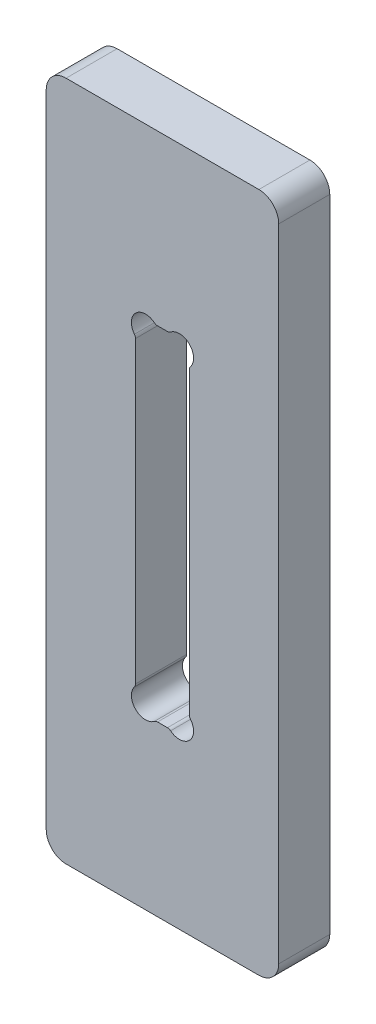
ISO-10303-21;
HEADER;
FILE_DESCRIPTION(('STEP AP214'),'2;1');
FILE_NAME('part.step','',(''),(''),'','','');
FILE_SCHEMA(('AUTOMOTIVE_DESIGN { 1 0 10303 214 1 1 1 1 }'));
ENDSEC;
DATA;
#1=APPLICATION_CONTEXT('core data for automotive mechanical design processes');
#2=APPLICATION_PROTOCOL_DEFINITION('international standard','automotive_design',2000,#1);
#3=PRODUCT_CONTEXT('',#1,'mechanical');
#4=PRODUCT('Part','Part','',(#3));
#5=PRODUCT_RELATED_PRODUCT_CATEGORY('part','',(#4));
#6=PRODUCT_DEFINITION_FORMATION('','',#4);
#7=PRODUCT_DEFINITION_CONTEXT('part definition',#1,'design');
#8=PRODUCT_DEFINITION('design','',#6,#7);
#9=PRODUCT_DEFINITION_SHAPE('','',#8);
#10=(LENGTH_UNIT() NAMED_UNIT(*) SI_UNIT(.MILLI.,.METRE.));
#11=(NAMED_UNIT(*) PLANE_ANGLE_UNIT() SI_UNIT($,.RADIAN.));
#12=(NAMED_UNIT(*) SI_UNIT($,.STERADIAN.) SOLID_ANGLE_UNIT());
#13=UNCERTAINTY_MEASURE_WITH_UNIT(LENGTH_MEASURE(1.E-05),#10,'distance_accuracy_value','');
#14=(GEOMETRIC_REPRESENTATION_CONTEXT(3) GLOBAL_UNCERTAINTY_ASSIGNED_CONTEXT((#13)) GLOBAL_UNIT_ASSIGNED_CONTEXT((#10,
#11,#12)) REPRESENTATION_CONTEXT('',''));
#15=CARTESIAN_POINT('',(0.,0.,0.));
#16=DIRECTION('',(0.,0.,1.));
#17=DIRECTION('',(1.,0.,0.));
#18=AXIS2_PLACEMENT_3D('',#15,#16,#17);
#19=CARTESIAN_POINT('',(0.,0.,18.));
#20=DIRECTION('',(0.,0.,-1.));
#21=DIRECTION('',(-1.,0.,0.));
#22=AXIS2_PLACEMENT_3D('',#19,#20,#21);
#23=PLANE('',#22);
#24=DIRECTION('',(0.,-1.,0.));
#25=VECTOR('',#24,1.);
#26=CARTESIAN_POINT('',(0.,0.,18.));
#27=LINE('',#26,#25);
#28=CARTESIAN_POINT('',(0.,233.,18.));
#29=VERTEX_POINT('',#28);
#30=CARTESIAN_POINT('',(0.,7.,18.));
#31=VERTEX_POINT('',#30);
#32=EDGE_CURVE('E322',#29,#31,#27,.T.);
#33=ORIENTED_EDGE('',*,*,#32,.T.);
#34=CARTESIAN_POINT('',(7.,7.,18.));
#35=DIRECTION('',(0.,0.,-1.));
#36=DIRECTION('',(-1.,0.,0.));
#37=AXIS2_PLACEMENT_3D('',#34,#35,#36);
#38=CIRCLE('',#37,7.);
#39=CARTESIAN_POINT('',(7.,0.,18.));
#40=VERTEX_POINT('',#39);
#41=EDGE_CURVE('E365',#31,#40,#38,.F.);
#42=ORIENTED_EDGE('',*,*,#41,.T.);
#43=DIRECTION('',(1.,0.,0.));
#44=VECTOR('',#43,1.);
#45=CARTESIAN_POINT('',(0.,0.,18.));
#46=LINE('',#45,#44);
#47=CARTESIAN_POINT('',(75.,0.,18.));
#48=VERTEX_POINT('',#47);
#49=EDGE_CURVE('E325',#40,#48,#46,.T.);
#50=ORIENTED_EDGE('',*,*,#49,.T.);
#51=CARTESIAN_POINT('',(75.,7.,18.));
#52=DIRECTION('',(0.,0.,-1.));
#53=DIRECTION('',(-1.,0.,0.));
#54=AXIS2_PLACEMENT_3D('',#51,#52,#53);
#55=CIRCLE('',#54,7.);
#56=CARTESIAN_POINT('',(82.,7.,18.));
#57=VERTEX_POINT('',#56);
#58=EDGE_CURVE('E361',#48,#57,#55,.F.);
#59=ORIENTED_EDGE('',*,*,#58,.T.);
#60=DIRECTION('',(0.,1.,0.));
#61=VECTOR('',#60,1.);
#62=CARTESIAN_POINT('',(82.,0.,18.));
#63=LINE('',#62,#61);
#64=CARTESIAN_POINT('',(82.,233.,18.));
#65=VERTEX_POINT('',#64);
#66=EDGE_CURVE('E329',#57,#65,#63,.T.);
#67=ORIENTED_EDGE('',*,*,#66,.T.);
#68=CARTESIAN_POINT('',(75.,233.,18.));
#69=DIRECTION('',(0.,0.,-1.));
#70=DIRECTION('',(-1.,0.,0.));
#71=AXIS2_PLACEMENT_3D('',#68,#69,#70);
#72=CIRCLE('',#71,7.);
#73=CARTESIAN_POINT('',(75.,240.,18.));
#74=VERTEX_POINT('',#73);
#75=EDGE_CURVE('E54',#65,#74,#72,.F.);
#76=ORIENTED_EDGE('',*,*,#75,.T.);
#77=DIRECTION('',(-1.,0.,0.));
#78=VECTOR('',#77,1.);
#79=CARTESIAN_POINT('',(0.,240.,18.));
#80=LINE('',#79,#78);
#81=CARTESIAN_POINT('',(7.,240.,18.));
#82=VERTEX_POINT('',#81);
#83=EDGE_CURVE('E331',#74,#82,#80,.T.);
#84=ORIENTED_EDGE('',*,*,#83,.T.);
#85=CARTESIAN_POINT('',(7.,233.,18.));
#86=DIRECTION('',(0.,0.,-1.));
#87=DIRECTION('',(-1.,0.,0.));
#88=AXIS2_PLACEMENT_3D('',#85,#86,#87);
#89=CIRCLE('',#88,7.);
#90=EDGE_CURVE('E363',#82,#29,#89,.F.);
#91=ORIENTED_EDGE('',*,*,#90,.T.);
#92=EDGE_LOOP('',(#33,#42,#50,#59,#67,#76,#84,#91));
#93=FACE_BOUND('',#92,.T.);
#94=CARTESIAN_POINT('',(29.7,67.2512281475307,18.));
#95=DIRECTION('',(0.,0.,-1.));
#96=DIRECTION('',(1.,0.,0.));
#97=AXIS2_PLACEMENT_3D('',#94,#95,#96);
#98=CIRCLE('',#97,1.80000000000001);
#99=CARTESIAN_POINT('',(31.5,67.2512281475307,18.));
#100=VERTEX_POINT('',#99);
#101=CARTESIAN_POINT('',(31.112347210394,66.1353090835783,18.));
#102=VERTEX_POINT('',#101);
#103=EDGE_CURVE('E196',#100,#102,#98,.T.);
#104=ORIENTED_EDGE('',*,*,#103,.F.);
#105=DIRECTION('',(0.,-1.,0.));
#106=VECTOR('',#105,1.);
#107=CARTESIAN_POINT('',(31.5,67.2512281475307,18.));
#108=LINE('',#107,#106);
#109=CARTESIAN_POINT('',(31.5,172.748771852469,18.));
#110=VERTEX_POINT('',#109);
#111=EDGE_CURVE('E248',#110,#100,#108,.T.);
#112=ORIENTED_EDGE('',*,*,#111,.F.);
#113=CARTESIAN_POINT('',(29.7,172.748771852469,18.));
#114=DIRECTION('',(0.,0.,-1.));
#115=DIRECTION('',(-1.,0.,0.));
#116=AXIS2_PLACEMENT_3D('',#113,#114,#115);
#117=CIRCLE('',#116,1.80000000000001);
#118=CARTESIAN_POINT('',(31.1123472103939,173.864690916422,18.));
#119=VERTEX_POINT('',#118);
#120=EDGE_CURVE('E245',#119,#110,#117,.T.);
#121=ORIENTED_EDGE('',*,*,#120,.F.);
#122=CARTESIAN_POINT('',(35.0355339059327,176.964466094067,18.));
#123=DIRECTION('',(0.,0.,1.));
#124=DIRECTION('',(-1.,0.,0.));
#125=AXIS2_PLACEMENT_3D('',#122,#123,#124);
#126=CIRCLE('',#125,5.);
#127=CARTESIAN_POINT('',(38.1353090835783,180.887652789606,18.));
#128=VERTEX_POINT('',#127);
#129=EDGE_CURVE('E243',#128,#119,#126,.T.);
#130=ORIENTED_EDGE('',*,*,#129,.F.);
#131=CARTESIAN_POINT('',(39.2512281475307,182.3,18.));
#132=DIRECTION('',(0.,0.,-1.));
#133=DIRECTION('',(1.,0.,0.));
#134=AXIS2_PLACEMENT_3D('',#131,#132,#133);
#135=CIRCLE('',#134,1.8);
#136=CARTESIAN_POINT('',(39.2512281475307,180.5,18.));
#137=VERTEX_POINT('',#136);
#138=EDGE_CURVE('E241',#137,#128,#135,.T.);
#139=ORIENTED_EDGE('',*,*,#138,.F.);
#140=DIRECTION('',(-1.,0.,0.));
#141=VECTOR('',#140,1.);
#142=CARTESIAN_POINT('',(39.2512281475307,180.5,18.));
#143=LINE('',#142,#141);
#144=CARTESIAN_POINT('',(42.7487718524693,180.5,18.));
#145=VERTEX_POINT('',#144);
#146=EDGE_CURVE('E239',#145,#137,#143,.T.);
#147=ORIENTED_EDGE('',*,*,#146,.F.);
#148=CARTESIAN_POINT('',(42.7487718524693,182.3,18.));
#149=DIRECTION('',(0.,0.,-1.));
#150=DIRECTION('',(-1.,0.,0.));
#151=AXIS2_PLACEMENT_3D('',#148,#149,#150);
#152=CIRCLE('',#151,1.8);
#153=CARTESIAN_POINT('',(43.8646909164217,180.887652789606,18.));
#154=VERTEX_POINT('',#153);
#155=EDGE_CURVE('E237',#154,#145,#152,.T.);
#156=ORIENTED_EDGE('',*,*,#155,.F.);
#157=CARTESIAN_POINT('',(46.9644660940673,176.964466094067,18.));
#158=DIRECTION('',(0.,0.,1.));
#159=DIRECTION('',(1.,0.,0.));
#160=AXIS2_PLACEMENT_3D('',#157,#158,#159);
#161=CIRCLE('',#160,5.);
#162=CARTESIAN_POINT('',(50.8876527896061,173.864690916422,18.));
#163=VERTEX_POINT('',#162);
#164=EDGE_CURVE('E235',#163,#154,#161,.T.);
#165=ORIENTED_EDGE('',*,*,#164,.F.);
#166=CARTESIAN_POINT('',(52.3,172.748771852469,18.));
#167=DIRECTION('',(0.,0.,-1.));
#168=DIRECTION('',(1.,0.,0.));
#169=AXIS2_PLACEMENT_3D('',#166,#167,#168);
#170=CIRCLE('',#169,1.80000000000001);
#171=CARTESIAN_POINT('',(50.5,172.748771852469,18.));
#172=VERTEX_POINT('',#171);
#173=EDGE_CURVE('E233',#172,#163,#170,.T.);
#174=ORIENTED_EDGE('',*,*,#173,.F.);
#175=DIRECTION('',(0.,1.,0.));
#176=VECTOR('',#175,1.);
#177=CARTESIAN_POINT('',(50.5,67.2512281475307,18.));
#178=LINE('',#177,#176);
#179=CARTESIAN_POINT('',(50.5,67.2512281475307,18.));
#180=VERTEX_POINT('',#179);
#181=EDGE_CURVE('E231',#180,#172,#178,.T.);
#182=ORIENTED_EDGE('',*,*,#181,.F.);
#183=CARTESIAN_POINT('',(52.3,67.2512281475307,18.));
#184=DIRECTION('',(0.,0.,-1.));
#185=DIRECTION('',(-1.,0.,0.));
#186=AXIS2_PLACEMENT_3D('',#183,#184,#185);
#187=CIRCLE('',#186,1.80000000000001);
#188=CARTESIAN_POINT('',(50.8876527896061,66.1353090835783,18.));
#189=VERTEX_POINT('',#188);
#190=EDGE_CURVE('E229',#189,#180,#187,.T.);
#191=ORIENTED_EDGE('',*,*,#190,.F.);
#192=CARTESIAN_POINT('',(46.9644660940673,63.0355339059327,18.));
#193=DIRECTION('',(0.,0.,1.));
#194=DIRECTION('',(-1.,0.,0.));
#195=AXIS2_PLACEMENT_3D('',#192,#193,#194);
#196=CIRCLE('',#195,5.);
#197=CARTESIAN_POINT('',(43.8646909164217,59.112347210394,18.));
#198=VERTEX_POINT('',#197);
#199=EDGE_CURVE('E227',#198,#189,#196,.T.);
#200=ORIENTED_EDGE('',*,*,#199,.F.);
#201=CARTESIAN_POINT('',(42.7487718524693,57.7,18.));
#202=DIRECTION('',(0.,0.,-1.));
#203=DIRECTION('',(1.,0.,0.));
#204=AXIS2_PLACEMENT_3D('',#201,#202,#203);
#205=CIRCLE('',#204,1.8);
#206=CARTESIAN_POINT('',(42.7487718524693,59.5,18.));
#207=VERTEX_POINT('',#206);
#208=EDGE_CURVE('E225',#207,#198,#205,.T.);
#209=ORIENTED_EDGE('',*,*,#208,.F.);
#210=DIRECTION('',(1.,0.,0.));
#211=VECTOR('',#210,1.);
#212=CARTESIAN_POINT('',(39.2512281475307,59.5,18.));
#213=LINE('',#212,#211);
#214=CARTESIAN_POINT('',(39.2512281475307,59.5,18.));
#215=VERTEX_POINT('',#214);
#216=EDGE_CURVE('E221',#215,#207,#213,.T.);
#217=ORIENTED_EDGE('',*,*,#216,.F.);
#218=CARTESIAN_POINT('',(39.2512281475307,57.7,18.));
#219=DIRECTION('',(0.,0.,-1.));
#220=DIRECTION('',(-1.,0.,0.));
#221=AXIS2_PLACEMENT_3D('',#218,#219,#220);
#222=CIRCLE('',#221,1.8);
#223=CARTESIAN_POINT('',(38.1353090835783,59.112347210394,18.));
#224=VERTEX_POINT('',#223);
#225=EDGE_CURVE('E219',#224,#215,#222,.T.);
#226=ORIENTED_EDGE('',*,*,#225,.F.);
#227=CARTESIAN_POINT('',(35.0355339059327,63.0355339059327,18.));
#228=DIRECTION('',(0.,0.,1.));
#229=DIRECTION('',(1.,0.,0.));
#230=AXIS2_PLACEMENT_3D('',#227,#228,#229);
#231=CIRCLE('',#230,5.);
#232=EDGE_CURVE('E206',#102,#224,#231,.T.);
#233=ORIENTED_EDGE('',*,*,#232,.F.);
#234=EDGE_LOOP('',(#104,#112,#121,#130,#139,#147,#156,#165,#174,#182,#191,#200,#209,#217,#226,#233));
#235=FACE_BOUND('',#234,.T.);
#236=ADVANCED_FACE('F32',(#93,#235),#23,.F.);
#237=CARTESIAN_POINT('',(0.,0.,0.));
#238=DIRECTION('',(0.,0.,-1.));
#239=DIRECTION('',(-1.,0.,0.));
#240=AXIS2_PLACEMENT_3D('',#237,#238,#239);
#241=PLANE('',#240);
#242=DIRECTION('',(1.,0.,0.));
#243=VECTOR('',#242,1.);
#244=CARTESIAN_POINT('',(0.,0.,0.));
#245=LINE('',#244,#243);
#246=CARTESIAN_POINT('',(7.,0.,0.));
#247=VERTEX_POINT('',#246);
#248=CARTESIAN_POINT('',(75.,0.,0.));
#249=VERTEX_POINT('',#248);
#250=EDGE_CURVE('E336',#247,#249,#245,.T.);
#251=ORIENTED_EDGE('',*,*,#250,.F.);
#252=CARTESIAN_POINT('',(7.,7.,0.));
#253=DIRECTION('',(0.,0.,-1.));
#254=DIRECTION('',(-1.,0.,0.));
#255=AXIS2_PLACEMENT_3D('',#252,#253,#254);
#256=CIRCLE('',#255,7.);
#257=CARTESIAN_POINT('',(0.,7.,0.));
#258=VERTEX_POINT('',#257);
#259=EDGE_CURVE('E353',#247,#258,#256,.T.);
#260=ORIENTED_EDGE('',*,*,#259,.T.);
#261=DIRECTION('',(0.,-1.,0.));
#262=VECTOR('',#261,1.);
#263=CARTESIAN_POINT('',(0.,0.,0.));
#264=LINE('',#263,#262);
#265=CARTESIAN_POINT('',(0.,233.,0.));
#266=VERTEX_POINT('',#265);
#267=EDGE_CURVE('E214',#266,#258,#264,.T.);
#268=ORIENTED_EDGE('',*,*,#267,.F.);
#269=CARTESIAN_POINT('',(7.,233.,0.));
#270=DIRECTION('',(0.,0.,-1.));
#271=DIRECTION('',(-1.,0.,0.));
#272=AXIS2_PLACEMENT_3D('',#269,#270,#271);
#273=CIRCLE('',#272,7.);
#274=CARTESIAN_POINT('',(7.,240.,0.));
#275=VERTEX_POINT('',#274);
#276=EDGE_CURVE('E351',#266,#275,#273,.T.);
#277=ORIENTED_EDGE('',*,*,#276,.T.);
#278=DIRECTION('',(-1.,0.,0.));
#279=VECTOR('',#278,1.);
#280=CARTESIAN_POINT('',(0.,240.,0.));
#281=LINE('',#280,#279);
#282=CARTESIAN_POINT('',(75.,240.,0.));
#283=VERTEX_POINT('',#282);
#284=EDGE_CURVE('E326',#283,#275,#281,.T.);
#285=ORIENTED_EDGE('',*,*,#284,.F.);
#286=CARTESIAN_POINT('',(75.,233.,0.));
#287=DIRECTION('',(0.,0.,-1.));
#288=DIRECTION('',(-1.,0.,0.));
#289=AXIS2_PLACEMENT_3D('',#286,#287,#288);
#290=CIRCLE('',#289,7.);
#291=CARTESIAN_POINT('',(82.,233.,0.));
#292=VERTEX_POINT('',#291);
#293=EDGE_CURVE('E347',#283,#292,#290,.T.);
#294=ORIENTED_EDGE('',*,*,#293,.T.);
#295=DIRECTION('',(0.,1.,0.));
#296=VECTOR('',#295,1.);
#297=CARTESIAN_POINT('',(82.,0.,0.));
#298=LINE('',#297,#296);
#299=CARTESIAN_POINT('',(82.,7.,0.));
#300=VERTEX_POINT('',#299);
#301=EDGE_CURVE('E339',#300,#292,#298,.T.);
#302=ORIENTED_EDGE('',*,*,#301,.F.);
#303=CARTESIAN_POINT('',(75.,7.,0.));
#304=DIRECTION('',(0.,0.,-1.));
#305=DIRECTION('',(-1.,0.,0.));
#306=AXIS2_PLACEMENT_3D('',#303,#304,#305);
#307=CIRCLE('',#306,7.);
#308=EDGE_CURVE('E349',#300,#249,#307,.T.);
#309=ORIENTED_EDGE('',*,*,#308,.T.);
#310=EDGE_LOOP('',(#251,#260,#268,#277,#285,#294,#302,#309));
#311=FACE_BOUND('',#310,.T.);
#312=DIRECTION('',(0.,-1.,0.));
#313=VECTOR('',#312,1.);
#314=CARTESIAN_POINT('',(31.5,67.2512281475307,0.));
#315=LINE('',#314,#313);
#316=CARTESIAN_POINT('',(31.5,172.748771852469,0.));
#317=VERTEX_POINT('',#316);
#318=CARTESIAN_POINT('',(31.5,67.2512281475307,0.));
#319=VERTEX_POINT('',#318);
#320=EDGE_CURVE('E207',#317,#319,#315,.T.);
#321=ORIENTED_EDGE('',*,*,#320,.T.);
#322=CARTESIAN_POINT('',(29.7,67.2512281475307,0.));
#323=DIRECTION('',(0.,0.,-1.));
#324=DIRECTION('',(1.,0.,0.));
#325=AXIS2_PLACEMENT_3D('',#322,#323,#324);
#326=CIRCLE('',#325,1.80000000000001);
#327=CARTESIAN_POINT('',(31.112347210394,66.1353090835783,0.));
#328=VERTEX_POINT('',#327);
#329=EDGE_CURVE('E250',#319,#328,#326,.T.);
#330=ORIENTED_EDGE('',*,*,#329,.T.);
#331=CARTESIAN_POINT('',(35.0355339059327,63.0355339059327,0.));
#332=DIRECTION('',(0.,0.,1.));
#333=DIRECTION('',(1.,0.,0.));
#334=AXIS2_PLACEMENT_3D('',#331,#332,#333);
#335=CIRCLE('',#334,5.);
#336=CARTESIAN_POINT('',(38.1353090835783,59.112347210394,0.));
#337=VERTEX_POINT('',#336);
#338=EDGE_CURVE('E213',#328,#337,#335,.T.);
#339=ORIENTED_EDGE('',*,*,#338,.T.);
#340=CARTESIAN_POINT('',(39.2512281475307,57.7,0.));
#341=DIRECTION('',(0.,0.,-1.));
#342=DIRECTION('',(-1.,0.,0.));
#343=AXIS2_PLACEMENT_3D('',#340,#341,#342);
#344=CIRCLE('',#343,1.8);
#345=CARTESIAN_POINT('',(39.2512281475307,59.5,0.));
#346=VERTEX_POINT('',#345);
#347=EDGE_CURVE('E253',#337,#346,#344,.T.);
#348=ORIENTED_EDGE('',*,*,#347,.T.);
#349=DIRECTION('',(1.,0.,0.));
#350=VECTOR('',#349,1.);
#351=CARTESIAN_POINT('',(39.2512281475307,59.5,0.));
#352=LINE('',#351,#350);
#353=CARTESIAN_POINT('',(42.7487718524693,59.5,0.));
#354=VERTEX_POINT('',#353);
#355=EDGE_CURVE('E256',#346,#354,#352,.T.);
#356=ORIENTED_EDGE('',*,*,#355,.T.);
#357=CARTESIAN_POINT('',(42.7487718524693,57.7,0.));
#358=DIRECTION('',(0.,0.,-1.));
#359=DIRECTION('',(1.,0.,0.));
#360=AXIS2_PLACEMENT_3D('',#357,#358,#359);
#361=CIRCLE('',#360,1.8);
#362=CARTESIAN_POINT('',(43.8646909164217,59.112347210394,0.));
#363=VERTEX_POINT('',#362);
#364=EDGE_CURVE('E259',#354,#363,#361,.T.);
#365=ORIENTED_EDGE('',*,*,#364,.T.);
#366=CARTESIAN_POINT('',(46.9644660940673,63.0355339059327,0.));
#367=DIRECTION('',(0.,0.,1.));
#368=DIRECTION('',(-1.,0.,0.));
#369=AXIS2_PLACEMENT_3D('',#366,#367,#368);
#370=CIRCLE('',#369,5.);
#371=CARTESIAN_POINT('',(50.8876527896061,66.1353090835783,0.));
#372=VERTEX_POINT('',#371);
#373=EDGE_CURVE('E262',#363,#372,#370,.T.);
#374=ORIENTED_EDGE('',*,*,#373,.T.);
#375=CARTESIAN_POINT('',(52.3,67.2512281475307,0.));
#376=DIRECTION('',(0.,0.,-1.));
#377=DIRECTION('',(-1.,0.,0.));
#378=AXIS2_PLACEMENT_3D('',#375,#376,#377);
#379=CIRCLE('',#378,1.80000000000001);
#380=CARTESIAN_POINT('',(50.5,67.2512281475307,0.));
#381=VERTEX_POINT('',#380);
#382=EDGE_CURVE('E265',#372,#381,#379,.T.);
#383=ORIENTED_EDGE('',*,*,#382,.T.);
#384=DIRECTION('',(0.,1.,0.));
#385=VECTOR('',#384,1.);
#386=CARTESIAN_POINT('',(50.5,67.2512281475307,0.));
#387=LINE('',#386,#385);
#388=CARTESIAN_POINT('',(50.5,172.748771852469,0.));
#389=VERTEX_POINT('',#388);
#390=EDGE_CURVE('E268',#381,#389,#387,.T.);
#391=ORIENTED_EDGE('',*,*,#390,.T.);
#392=CARTESIAN_POINT('',(52.3,172.748771852469,0.));
#393=DIRECTION('',(0.,0.,-1.));
#394=DIRECTION('',(1.,0.,0.));
#395=AXIS2_PLACEMENT_3D('',#392,#393,#394);
#396=CIRCLE('',#395,1.80000000000001);
#397=CARTESIAN_POINT('',(50.8876527896061,173.864690916422,0.));
#398=VERTEX_POINT('',#397);
#399=EDGE_CURVE('E271',#389,#398,#396,.T.);
#400=ORIENTED_EDGE('',*,*,#399,.T.);
#401=CARTESIAN_POINT('',(46.9644660940673,176.964466094067,0.));
#402=DIRECTION('',(0.,0.,1.));
#403=DIRECTION('',(1.,0.,0.));
#404=AXIS2_PLACEMENT_3D('',#401,#402,#403);
#405=CIRCLE('',#404,5.);
#406=CARTESIAN_POINT('',(43.8646909164217,180.887652789606,0.));
#407=VERTEX_POINT('',#406);
#408=EDGE_CURVE('E274',#398,#407,#405,.T.);
#409=ORIENTED_EDGE('',*,*,#408,.T.);
#410=CARTESIAN_POINT('',(42.7487718524693,182.3,0.));
#411=DIRECTION('',(0.,0.,-1.));
#412=DIRECTION('',(-1.,0.,0.));
#413=AXIS2_PLACEMENT_3D('',#410,#411,#412);
#414=CIRCLE('',#413,1.8);
#415=CARTESIAN_POINT('',(42.7487718524693,180.5,0.));
#416=VERTEX_POINT('',#415);
#417=EDGE_CURVE('E277',#407,#416,#414,.T.);
#418=ORIENTED_EDGE('',*,*,#417,.T.);
#419=DIRECTION('',(-1.,0.,0.));
#420=VECTOR('',#419,1.);
#421=CARTESIAN_POINT('',(39.2512281475307,180.5,0.));
#422=LINE('',#421,#420);
#423=CARTESIAN_POINT('',(39.2512281475307,180.5,0.));
#424=VERTEX_POINT('',#423);
#425=EDGE_CURVE('E280',#416,#424,#422,.T.);
#426=ORIENTED_EDGE('',*,*,#425,.T.);
#427=CARTESIAN_POINT('',(39.2512281475307,182.3,0.));
#428=DIRECTION('',(0.,0.,-1.));
#429=DIRECTION('',(1.,0.,0.));
#430=AXIS2_PLACEMENT_3D('',#427,#428,#429);
#431=CIRCLE('',#430,1.8);
#432=CARTESIAN_POINT('',(38.1353090835783,180.887652789606,0.));
#433=VERTEX_POINT('',#432);
#434=EDGE_CURVE('E283',#424,#433,#431,.T.);
#435=ORIENTED_EDGE('',*,*,#434,.T.);
#436=CARTESIAN_POINT('',(35.0355339059327,176.964466094067,0.));
#437=DIRECTION('',(0.,0.,1.));
#438=DIRECTION('',(-1.,0.,0.));
#439=AXIS2_PLACEMENT_3D('',#436,#437,#438);
#440=CIRCLE('',#439,5.);
#441=CARTESIAN_POINT('',(31.1123472103939,173.864690916422,0.));
#442=VERTEX_POINT('',#441);
#443=EDGE_CURVE('E286',#433,#442,#440,.T.);
#444=ORIENTED_EDGE('',*,*,#443,.T.);
#445=CARTESIAN_POINT('',(29.7,172.748771852469,0.));
#446=DIRECTION('',(0.,0.,-1.));
#447=DIRECTION('',(-1.,0.,0.));
#448=AXIS2_PLACEMENT_3D('',#445,#446,#447);
#449=CIRCLE('',#448,1.80000000000001);
#450=EDGE_CURVE('E289',#442,#317,#449,.T.);
#451=ORIENTED_EDGE('',*,*,#450,.T.);
#452=EDGE_LOOP('',(#321,#330,#339,#348,#356,#365,#374,#383,#391,#400,#409,#418,#426,#435,#444,#451));
#453=FACE_BOUND('',#452,.T.);
#454=ADVANCED_FACE('F383',(#311,#453),#241,.T.);
#455=CARTESIAN_POINT('',(0.,0.,18.));
#456=DIRECTION('',(1.,0.,0.));
#457=DIRECTION('',(0.,0.,-1.));
#458=AXIS2_PLACEMENT_3D('',#455,#456,#457);
#459=PLANE('',#458);
#460=ORIENTED_EDGE('',*,*,#267,.T.);
#461=DIRECTION('',(0.,0.,-1.));
#462=VECTOR('',#461,1.);
#463=CARTESIAN_POINT('',(0.,7.,18.));
#464=LINE('',#463,#462);
#465=EDGE_CURVE('E358',#258,#31,#464,.F.);
#466=ORIENTED_EDGE('',*,*,#465,.T.);
#467=ORIENTED_EDGE('',*,*,#32,.F.);
#468=DIRECTION('',(0.,0.,-1.));
#469=VECTOR('',#468,1.);
#470=CARTESIAN_POINT('',(0.,233.,18.));
#471=LINE('',#470,#469);
#472=EDGE_CURVE('E355',#29,#266,#471,.T.);
#473=ORIENTED_EDGE('',*,*,#472,.T.);
#474=EDGE_LOOP('',(#460,#466,#467,#473));
#475=FACE_BOUND('',#474,.T.);
#476=ADVANCED_FACE('F392',(#475),#459,.F.);
#477=CARTESIAN_POINT('',(0.,0.,18.));
#478=DIRECTION('',(0.,1.,0.));
#479=DIRECTION('',(0.,0.,1.));
#480=AXIS2_PLACEMENT_3D('',#477,#478,#479);
#481=PLANE('',#480);
#482=ORIENTED_EDGE('',*,*,#49,.F.);
#483=DIRECTION('',(0.,0.,-1.));
#484=VECTOR('',#483,1.);
#485=CARTESIAN_POINT('',(7.,0.,18.));
#486=LINE('',#485,#484);
#487=EDGE_CURVE('E344',#40,#247,#486,.T.);
#488=ORIENTED_EDGE('',*,*,#487,.T.);
#489=ORIENTED_EDGE('',*,*,#250,.T.);
#490=DIRECTION('',(0.,0.,-1.));
#491=VECTOR('',#490,1.);
#492=CARTESIAN_POINT('',(75.,0.,18.));
#493=LINE('',#492,#491);
#494=EDGE_CURVE('E333',#249,#48,#493,.F.);
#495=ORIENTED_EDGE('',*,*,#494,.T.);
#496=EDGE_LOOP('',(#482,#488,#489,#495));
#497=FACE_BOUND('',#496,.T.);
#498=ADVANCED_FACE('F400',(#497),#481,.F.);
#499=CARTESIAN_POINT('',(82.,0.,18.));
#500=DIRECTION('',(-1.,0.,0.));
#501=DIRECTION('',(0.,0.,1.));
#502=AXIS2_PLACEMENT_3D('',#499,#500,#501);
#503=PLANE('',#502);
#504=ORIENTED_EDGE('',*,*,#66,.F.);
#505=DIRECTION('',(0.,0.,-1.));
#506=VECTOR('',#505,1.);
#507=CARTESIAN_POINT('',(82.,7.,18.));
#508=LINE('',#507,#506);
#509=EDGE_CURVE('E11',#57,#300,#508,.T.);
#510=ORIENTED_EDGE('',*,*,#509,.T.);
#511=ORIENTED_EDGE('',*,*,#301,.T.);
#512=DIRECTION('',(0.,0.,-1.));
#513=VECTOR('',#512,1.);
#514=CARTESIAN_POINT('',(82.,233.,18.));
#515=LINE('',#514,#513);
#516=EDGE_CURVE('E40',#292,#65,#515,.F.);
#517=ORIENTED_EDGE('',*,*,#516,.T.);
#518=EDGE_LOOP('',(#504,#510,#511,#517));
#519=FACE_BOUND('',#518,.T.);
#520=ADVANCED_FACE('F373',(#519),#503,.F.);
#521=CARTESIAN_POINT('',(0.,240.,18.));
#522=DIRECTION('',(0.,-1.,0.));
#523=DIRECTION('',(0.,0.,-1.));
#524=AXIS2_PLACEMENT_3D('',#521,#522,#523);
#525=PLANE('',#524);
#526=ORIENTED_EDGE('',*,*,#284,.T.);
#527=DIRECTION('',(0.,0.,-1.));
#528=VECTOR('',#527,1.);
#529=CARTESIAN_POINT('',(7.,240.,18.));
#530=LINE('',#529,#528);
#531=EDGE_CURVE('E47',#275,#82,#530,.F.);
#532=ORIENTED_EDGE('',*,*,#531,.T.);
#533=ORIENTED_EDGE('',*,*,#83,.F.);
#534=DIRECTION('',(0.,0.,-1.));
#535=VECTOR('',#534,1.);
#536=CARTESIAN_POINT('',(75.,240.,18.));
#537=LINE('',#536,#535);
#538=EDGE_CURVE('E367',#74,#283,#537,.T.);
#539=ORIENTED_EDGE('',*,*,#538,.T.);
#540=EDGE_LOOP('',(#526,#532,#533,#539));
#541=FACE_BOUND('',#540,.T.);
#542=ADVANCED_FACE('F380',(#541),#525,.F.);
#543=CARTESIAN_POINT('',(29.7,67.2512281475307,18.));
#544=DIRECTION('',(0.,0.,-1.));
#545=DIRECTION('',(-1.,0.,0.));
#546=AXIS2_PLACEMENT_3D('',#543,#544,#545);
#547=CYLINDRICAL_SURFACE('',#546,1.80000000000001);
#548=ORIENTED_EDGE('',*,*,#329,.F.);
#549=DIRECTION('',(0.,0.,-1.));
#550=VECTOR('',#549,1.);
#551=CARTESIAN_POINT('',(31.5,67.2512281475307,18.));
#552=LINE('',#551,#550);
#553=EDGE_CURVE('E202',#100,#319,#552,.T.);
#554=ORIENTED_EDGE('',*,*,#553,.F.);
#555=ORIENTED_EDGE('',*,*,#103,.T.);
#556=DIRECTION('',(0.,0.,-1.));
#557=VECTOR('',#556,1.);
#558=CARTESIAN_POINT('',(31.112347210394,66.1353090835783,18.));
#559=LINE('',#558,#557);
#560=EDGE_CURVE('E199',#102,#328,#559,.T.);
#561=ORIENTED_EDGE('',*,*,#560,.T.);
#562=EDGE_LOOP('',(#548,#554,#555,#561));
#563=FACE_BOUND('',#562,.T.);
#564=ADVANCED_FACE('F198',(#563),#547,.T.);
#565=CARTESIAN_POINT('',(35.0355339059327,63.0355339059327,18.));
#566=DIRECTION('',(0.,0.,-1.));
#567=DIRECTION('',(-1.,0.,0.));
#568=AXIS2_PLACEMENT_3D('',#565,#566,#567);
#569=CYLINDRICAL_SURFACE('',#568,5.);
#570=ORIENTED_EDGE('',*,*,#338,.F.);
#571=ORIENTED_EDGE('',*,*,#560,.F.);
#572=ORIENTED_EDGE('',*,*,#232,.T.);
#573=DIRECTION('',(0.,0.,-1.));
#574=VECTOR('',#573,1.);
#575=CARTESIAN_POINT('',(38.1353090835783,59.112347210394,18.));
#576=LINE('',#575,#574);
#577=EDGE_CURVE('E215',#224,#337,#576,.T.);
#578=ORIENTED_EDGE('',*,*,#577,.T.);
#579=EDGE_LOOP('',(#570,#571,#572,#578));
#580=FACE_BOUND('',#579,.T.);
#581=ADVANCED_FACE('F210',(#580),#569,.F.);
#582=CARTESIAN_POINT('',(39.2512281475307,57.7,18.));
#583=DIRECTION('',(0.,0.,-1.));
#584=DIRECTION('',(-1.,0.,0.));
#585=AXIS2_PLACEMENT_3D('',#582,#583,#584);
#586=CYLINDRICAL_SURFACE('',#585,1.8);
#587=ORIENTED_EDGE('',*,*,#347,.F.);
#588=ORIENTED_EDGE('',*,*,#577,.F.);
#589=ORIENTED_EDGE('',*,*,#225,.T.);
#590=DIRECTION('',(0.,0.,-1.));
#591=VECTOR('',#590,1.);
#592=CARTESIAN_POINT('',(39.2512281475307,59.5,18.));
#593=LINE('',#592,#591);
#594=EDGE_CURVE('E319',#215,#346,#593,.T.);
#595=ORIENTED_EDGE('',*,*,#594,.T.);
#596=EDGE_LOOP('',(#587,#588,#589,#595));
#597=FACE_BOUND('',#596,.T.);
#598=ADVANCED_FACE('F485',(#597),#586,.T.);
#599=CARTESIAN_POINT('',(39.2512281475307,59.5,18.));
#600=DIRECTION('',(0.,1.,0.));
#601=DIRECTION('',(0.,0.,1.));
#602=AXIS2_PLACEMENT_3D('',#599,#600,#601);
#603=PLANE('',#602);
#604=ORIENTED_EDGE('',*,*,#355,.F.);
#605=ORIENTED_EDGE('',*,*,#594,.F.);
#606=ORIENTED_EDGE('',*,*,#216,.T.);
#607=DIRECTION('',(0.,0.,-1.));
#608=VECTOR('',#607,1.);
#609=CARTESIAN_POINT('',(42.7487718524693,59.5,18.));
#610=LINE('',#609,#608);
#611=EDGE_CURVE('E317',#207,#354,#610,.T.);
#612=ORIENTED_EDGE('',*,*,#611,.T.);
#613=EDGE_LOOP('',(#604,#605,#606,#612));
#614=FACE_BOUND('',#613,.T.);
#615=ADVANCED_FACE('F481',(#614),#603,.T.);
#616=CARTESIAN_POINT('',(42.7487718524693,57.7,18.));
#617=DIRECTION('',(0.,0.,-1.));
#618=DIRECTION('',(-1.,0.,0.));
#619=AXIS2_PLACEMENT_3D('',#616,#617,#618);
#620=CYLINDRICAL_SURFACE('',#619,1.8);
#621=ORIENTED_EDGE('',*,*,#364,.F.);
#622=ORIENTED_EDGE('',*,*,#611,.F.);
#623=ORIENTED_EDGE('',*,*,#208,.T.);
#624=DIRECTION('',(0.,0.,-1.));
#625=VECTOR('',#624,1.);
#626=CARTESIAN_POINT('',(43.8646909164217,59.112347210394,18.));
#627=LINE('',#626,#625);
#628=EDGE_CURVE('E315',#198,#363,#627,.T.);
#629=ORIENTED_EDGE('',*,*,#628,.T.);
#630=EDGE_LOOP('',(#621,#622,#623,#629));
#631=FACE_BOUND('',#630,.T.);
#632=ADVANCED_FACE('F477',(#631),#620,.T.);
#633=CARTESIAN_POINT('',(46.9644660940673,63.0355339059327,18.));
#634=DIRECTION('',(0.,0.,-1.));
#635=DIRECTION('',(-1.,0.,0.));
#636=AXIS2_PLACEMENT_3D('',#633,#634,#635);
#637=CYLINDRICAL_SURFACE('',#636,5.);
#638=ORIENTED_EDGE('',*,*,#373,.F.);
#639=ORIENTED_EDGE('',*,*,#628,.F.);
#640=ORIENTED_EDGE('',*,*,#199,.T.);
#641=DIRECTION('',(0.,0.,-1.));
#642=VECTOR('',#641,1.);
#643=CARTESIAN_POINT('',(50.8876527896061,66.1353090835783,18.));
#644=LINE('',#643,#642);
#645=EDGE_CURVE('E313',#189,#372,#644,.T.);
#646=ORIENTED_EDGE('',*,*,#645,.T.);
#647=EDGE_LOOP('',(#638,#639,#640,#646));
#648=FACE_BOUND('',#647,.T.);
#649=ADVANCED_FACE('F473',(#648),#637,.F.);
#650=CARTESIAN_POINT('',(52.3,67.2512281475307,18.));
#651=DIRECTION('',(0.,0.,-1.));
#652=DIRECTION('',(-1.,0.,0.));
#653=AXIS2_PLACEMENT_3D('',#650,#651,#652);
#654=CYLINDRICAL_SURFACE('',#653,1.80000000000001);
#655=ORIENTED_EDGE('',*,*,#382,.F.);
#656=ORIENTED_EDGE('',*,*,#645,.F.);
#657=ORIENTED_EDGE('',*,*,#190,.T.);
#658=DIRECTION('',(0.,0.,-1.));
#659=VECTOR('',#658,1.);
#660=CARTESIAN_POINT('',(50.5,67.2512281475307,18.));
#661=LINE('',#660,#659);
#662=EDGE_CURVE('E311',#180,#381,#661,.T.);
#663=ORIENTED_EDGE('',*,*,#662,.T.);
#664=EDGE_LOOP('',(#655,#656,#657,#663));
#665=FACE_BOUND('',#664,.T.);
#666=ADVANCED_FACE('F469',(#665),#654,.T.);
#667=CARTESIAN_POINT('',(50.5,67.2512281475307,18.));
#668=DIRECTION('',(-1.,0.,0.));
#669=DIRECTION('',(0.,0.,1.));
#670=AXIS2_PLACEMENT_3D('',#667,#668,#669);
#671=PLANE('',#670);
#672=ORIENTED_EDGE('',*,*,#390,.F.);
#673=ORIENTED_EDGE('',*,*,#662,.F.);
#674=ORIENTED_EDGE('',*,*,#181,.T.);
#675=DIRECTION('',(0.,0.,-1.));
#676=VECTOR('',#675,1.);
#677=CARTESIAN_POINT('',(50.5,172.748771852469,18.));
#678=LINE('',#677,#676);
#679=EDGE_CURVE('E309',#172,#389,#678,.T.);
#680=ORIENTED_EDGE('',*,*,#679,.T.);
#681=EDGE_LOOP('',(#672,#673,#674,#680));
#682=FACE_BOUND('',#681,.T.);
#683=ADVANCED_FACE('F465',(#682),#671,.T.);
#684=CARTESIAN_POINT('',(52.3,172.748771852469,18.));
#685=DIRECTION('',(0.,0.,-1.));
#686=DIRECTION('',(-1.,0.,0.));
#687=AXIS2_PLACEMENT_3D('',#684,#685,#686);
#688=CYLINDRICAL_SURFACE('',#687,1.80000000000001);
#689=ORIENTED_EDGE('',*,*,#399,.F.);
#690=ORIENTED_EDGE('',*,*,#679,.F.);
#691=ORIENTED_EDGE('',*,*,#173,.T.);
#692=DIRECTION('',(0.,0.,-1.));
#693=VECTOR('',#692,1.);
#694=CARTESIAN_POINT('',(50.8876527896061,173.864690916422,18.));
#695=LINE('',#694,#693);
#696=EDGE_CURVE('E307',#163,#398,#695,.T.);
#697=ORIENTED_EDGE('',*,*,#696,.T.);
#698=EDGE_LOOP('',(#689,#690,#691,#697));
#699=FACE_BOUND('',#698,.T.);
#700=ADVANCED_FACE('F461',(#699),#688,.T.);
#701=CARTESIAN_POINT('',(46.9644660940673,176.964466094067,18.));
#702=DIRECTION('',(0.,0.,-1.));
#703=DIRECTION('',(-1.,0.,0.));
#704=AXIS2_PLACEMENT_3D('',#701,#702,#703);
#705=CYLINDRICAL_SURFACE('',#704,5.);
#706=ORIENTED_EDGE('',*,*,#408,.F.);
#707=ORIENTED_EDGE('',*,*,#696,.F.);
#708=ORIENTED_EDGE('',*,*,#164,.T.);
#709=DIRECTION('',(0.,0.,-1.));
#710=VECTOR('',#709,1.);
#711=CARTESIAN_POINT('',(43.8646909164217,180.887652789606,18.));
#712=LINE('',#711,#710);
#713=EDGE_CURVE('E305',#154,#407,#712,.T.);
#714=ORIENTED_EDGE('',*,*,#713,.T.);
#715=EDGE_LOOP('',(#706,#707,#708,#714));
#716=FACE_BOUND('',#715,.T.);
#717=ADVANCED_FACE('F457',(#716),#705,.F.);
#718=CARTESIAN_POINT('',(42.7487718524693,182.3,18.));
#719=DIRECTION('',(0.,0.,-1.));
#720=DIRECTION('',(-1.,0.,0.));
#721=AXIS2_PLACEMENT_3D('',#718,#719,#720);
#722=CYLINDRICAL_SURFACE('',#721,1.8);
#723=ORIENTED_EDGE('',*,*,#417,.F.);
#724=ORIENTED_EDGE('',*,*,#713,.F.);
#725=ORIENTED_EDGE('',*,*,#155,.T.);
#726=DIRECTION('',(0.,0.,-1.));
#727=VECTOR('',#726,1.);
#728=CARTESIAN_POINT('',(42.7487718524693,180.5,18.));
#729=LINE('',#728,#727);
#730=EDGE_CURVE('E303',#145,#416,#729,.T.);
#731=ORIENTED_EDGE('',*,*,#730,.T.);
#732=EDGE_LOOP('',(#723,#724,#725,#731));
#733=FACE_BOUND('',#732,.T.);
#734=ADVANCED_FACE('F453',(#733),#722,.T.);
#735=CARTESIAN_POINT('',(39.2512281475307,180.5,18.));
#736=DIRECTION('',(0.,-1.,0.));
#737=DIRECTION('',(0.,0.,-1.));
#738=AXIS2_PLACEMENT_3D('',#735,#736,#737);
#739=PLANE('',#738);
#740=ORIENTED_EDGE('',*,*,#425,.F.);
#741=ORIENTED_EDGE('',*,*,#730,.F.);
#742=ORIENTED_EDGE('',*,*,#146,.T.);
#743=DIRECTION('',(0.,0.,-1.));
#744=VECTOR('',#743,1.);
#745=CARTESIAN_POINT('',(39.2512281475307,180.5,18.));
#746=LINE('',#745,#744);
#747=EDGE_CURVE('E301',#137,#424,#746,.T.);
#748=ORIENTED_EDGE('',*,*,#747,.T.);
#749=EDGE_LOOP('',(#740,#741,#742,#748));
#750=FACE_BOUND('',#749,.T.);
#751=ADVANCED_FACE('F449',(#750),#739,.T.);
#752=CARTESIAN_POINT('',(39.2512281475307,182.3,18.));
#753=DIRECTION('',(0.,0.,-1.));
#754=DIRECTION('',(-1.,0.,0.));
#755=AXIS2_PLACEMENT_3D('',#752,#753,#754);
#756=CYLINDRICAL_SURFACE('',#755,1.8);
#757=ORIENTED_EDGE('',*,*,#434,.F.);
#758=ORIENTED_EDGE('',*,*,#747,.F.);
#759=ORIENTED_EDGE('',*,*,#138,.T.);
#760=DIRECTION('',(0.,0.,-1.));
#761=VECTOR('',#760,1.);
#762=CARTESIAN_POINT('',(38.1353090835783,180.887652789606,18.));
#763=LINE('',#762,#761);
#764=EDGE_CURVE('E299',#128,#433,#763,.T.);
#765=ORIENTED_EDGE('',*,*,#764,.T.);
#766=EDGE_LOOP('',(#757,#758,#759,#765));
#767=FACE_BOUND('',#766,.T.);
#768=ADVANCED_FACE('F445',(#767),#756,.T.);
#769=CARTESIAN_POINT('',(35.0355339059327,176.964466094067,18.));
#770=DIRECTION('',(0.,0.,-1.));
#771=DIRECTION('',(-1.,0.,0.));
#772=AXIS2_PLACEMENT_3D('',#769,#770,#771);
#773=CYLINDRICAL_SURFACE('',#772,5.);
#774=ORIENTED_EDGE('',*,*,#443,.F.);
#775=ORIENTED_EDGE('',*,*,#764,.F.);
#776=ORIENTED_EDGE('',*,*,#129,.T.);
#777=DIRECTION('',(0.,0.,-1.));
#778=VECTOR('',#777,1.);
#779=CARTESIAN_POINT('',(31.1123472103939,173.864690916422,18.));
#780=LINE('',#779,#778);
#781=EDGE_CURVE('E297',#119,#442,#780,.T.);
#782=ORIENTED_EDGE('',*,*,#781,.T.);
#783=EDGE_LOOP('',(#774,#775,#776,#782));
#784=FACE_BOUND('',#783,.T.);
#785=ADVANCED_FACE('F438',(#784),#773,.F.);
#786=CARTESIAN_POINT('',(29.7,172.748771852469,18.));
#787=DIRECTION('',(0.,0.,-1.));
#788=DIRECTION('',(-1.,0.,0.));
#789=AXIS2_PLACEMENT_3D('',#786,#787,#788);
#790=CYLINDRICAL_SURFACE('',#789,1.80000000000001);
#791=ORIENTED_EDGE('',*,*,#450,.F.);
#792=ORIENTED_EDGE('',*,*,#781,.F.);
#793=ORIENTED_EDGE('',*,*,#120,.T.);
#794=DIRECTION('',(0.,0.,-1.));
#795=VECTOR('',#794,1.);
#796=CARTESIAN_POINT('',(31.5,172.748771852469,18.));
#797=LINE('',#796,#795);
#798=EDGE_CURVE('E295',#110,#317,#797,.T.);
#799=ORIENTED_EDGE('',*,*,#798,.T.);
#800=EDGE_LOOP('',(#791,#792,#793,#799));
#801=FACE_BOUND('',#800,.T.);
#802=ADVANCED_FACE('F432',(#801),#790,.T.);
#803=CARTESIAN_POINT('',(31.5,67.2512281475307,18.));
#804=DIRECTION('',(1.,0.,0.));
#805=DIRECTION('',(0.,1.,0.));
#806=AXIS2_PLACEMENT_3D('',#803,#804,#805);
#807=PLANE('',#806);
#808=ORIENTED_EDGE('',*,*,#320,.F.);
#809=ORIENTED_EDGE('',*,*,#798,.F.);
#810=ORIENTED_EDGE('',*,*,#111,.T.);
#811=ORIENTED_EDGE('',*,*,#553,.T.);
#812=EDGE_LOOP('',(#808,#809,#810,#811));
#813=FACE_BOUND('',#812,.T.);
#814=ADVANCED_FACE('F428',(#813),#807,.T.);
#815=CARTESIAN_POINT('',(7.,7.,18.));
#816=DIRECTION('',(0.,0.,-1.));
#817=DIRECTION('',(-1.,0.,0.));
#818=AXIS2_PLACEMENT_3D('',#815,#816,#817);
#819=CYLINDRICAL_SURFACE('',#818,7.);
#820=ORIENTED_EDGE('',*,*,#41,.F.);
#821=ORIENTED_EDGE('',*,*,#465,.F.);
#822=ORIENTED_EDGE('',*,*,#259,.F.);
#823=ORIENTED_EDGE('',*,*,#487,.F.);
#824=EDGE_LOOP('',(#820,#821,#822,#823));
#825=FACE_BOUND('',#824,.T.);
#826=ADVANCED_FACE('F398',(#825),#819,.T.);
#827=CARTESIAN_POINT('',(7.,233.,18.));
#828=DIRECTION('',(0.,0.,-1.));
#829=DIRECTION('',(-1.,0.,0.));
#830=AXIS2_PLACEMENT_3D('',#827,#828,#829);
#831=CYLINDRICAL_SURFACE('',#830,7.);
#832=ORIENTED_EDGE('',*,*,#90,.F.);
#833=ORIENTED_EDGE('',*,*,#531,.F.);
#834=ORIENTED_EDGE('',*,*,#276,.F.);
#835=ORIENTED_EDGE('',*,*,#472,.F.);
#836=EDGE_LOOP('',(#832,#833,#834,#835));
#837=FACE_BOUND('',#836,.T.);
#838=ADVANCED_FACE('F389',(#837),#831,.T.);
#839=CARTESIAN_POINT('',(75.,7.,18.));
#840=DIRECTION('',(0.,0.,-1.));
#841=DIRECTION('',(-1.,0.,0.));
#842=AXIS2_PLACEMENT_3D('',#839,#840,#841);
#843=CYLINDRICAL_SURFACE('',#842,7.);
#844=ORIENTED_EDGE('',*,*,#58,.F.);
#845=ORIENTED_EDGE('',*,*,#494,.F.);
#846=ORIENTED_EDGE('',*,*,#308,.F.);
#847=ORIENTED_EDGE('',*,*,#509,.F.);
#848=EDGE_LOOP('',(#844,#845,#846,#847));
#849=FACE_BOUND('',#848,.T.);
#850=ADVANCED_FACE('F403',(#849),#843,.T.);
#851=CARTESIAN_POINT('',(75.,233.,18.));
#852=DIRECTION('',(0.,0.,-1.));
#853=DIRECTION('',(-1.,0.,0.));
#854=AXIS2_PLACEMENT_3D('',#851,#852,#853);
#855=CYLINDRICAL_SURFACE('',#854,7.);
#856=ORIENTED_EDGE('',*,*,#75,.F.);
#857=ORIENTED_EDGE('',*,*,#516,.F.);
#858=ORIENTED_EDGE('',*,*,#293,.F.);
#859=ORIENTED_EDGE('',*,*,#538,.F.);
#860=EDGE_LOOP('',(#856,#857,#858,#859));
#861=FACE_BOUND('',#860,.T.);
#862=ADVANCED_FACE('F34',(#861),#855,.T.);
#863=CLOSED_SHELL('',(#236,#454,#476,#498,#520,#542,#564,#581,#598,#615,#632,#649,#666,#683,
#700,#717,#734,#751,#768,#785,#802,#814,#826,#838,#850,#862));
#864=MANIFOLD_SOLID_BREP('B2',#863);
#865=ADVANCED_BREP_SHAPE_REPRESENTATION('',(#18,#864),#14);
#866=SHAPE_DEFINITION_REPRESENTATION(#9,#865);
ENDSEC;
END-ISO-10303-21;
